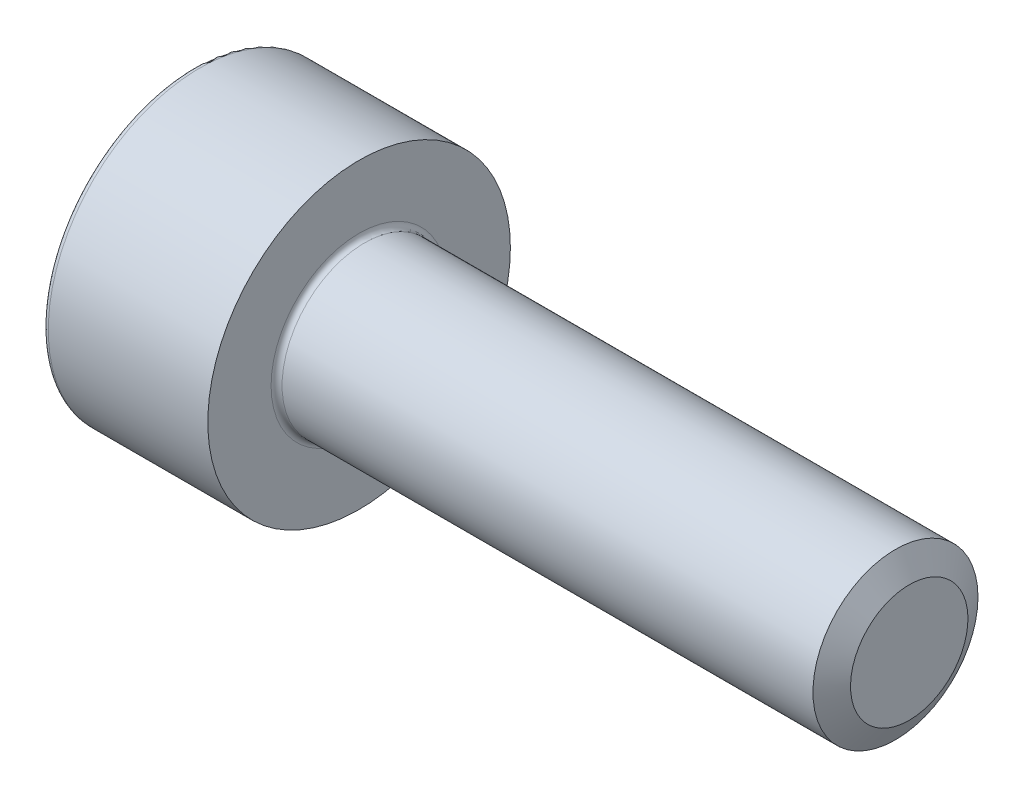
ISO-10303-21;
HEADER;
FILE_DESCRIPTION(('STEP AP214'),'2;1');
FILE_NAME('part.step','',(''),(''),'','','');
FILE_SCHEMA(('AUTOMOTIVE_DESIGN { 1 0 10303 214 1 1 1 1 }'));
ENDSEC;
DATA;
#1=APPLICATION_CONTEXT('core data for automotive mechanical design processes');
#2=APPLICATION_PROTOCOL_DEFINITION('international standard','automotive_design',2000,#1);
#3=PRODUCT_CONTEXT('',#1,'mechanical');
#4=PRODUCT('Part','Part','',(#3));
#5=PRODUCT_RELATED_PRODUCT_CATEGORY('part','',(#4));
#6=PRODUCT_DEFINITION_FORMATION('','',#4);
#7=PRODUCT_DEFINITION_CONTEXT('part definition',#1,'design');
#8=PRODUCT_DEFINITION('design','',#6,#7);
#9=PRODUCT_DEFINITION_SHAPE('','',#8);
#10=(LENGTH_UNIT() NAMED_UNIT(*) SI_UNIT(.MILLI.,.METRE.));
#11=(NAMED_UNIT(*) PLANE_ANGLE_UNIT() SI_UNIT($,.RADIAN.));
#12=(NAMED_UNIT(*) SI_UNIT($,.STERADIAN.) SOLID_ANGLE_UNIT());
#13=UNCERTAINTY_MEASURE_WITH_UNIT(LENGTH_MEASURE(1.E-05),#10,'distance_accuracy_value','');
#14=(GEOMETRIC_REPRESENTATION_CONTEXT(3) GLOBAL_UNCERTAINTY_ASSIGNED_CONTEXT((#13)) GLOBAL_UNIT_ASSIGNED_CONTEXT((#10,
#11,#12)) REPRESENTATION_CONTEXT('',''));
#15=CARTESIAN_POINT('',(0.,0.,0.));
#16=DIRECTION('',(0.,0.,1.));
#17=DIRECTION('',(1.,0.,0.));
#18=AXIS2_PLACEMENT_3D('',#15,#16,#17);
#19=CARTESIAN_POINT('',(1.3,-0.7175,1.24274645443067));
#20=DIRECTION('',(-1.,0.,0.));
#21=DIRECTION('',(0.,0.,1.));
#22=AXIS2_PLACEMENT_3D('',#19,#20,#21);
#23=PLANE('',#22);
#24=DIRECTION('',(0.,1.,0.));
#25=VECTOR('',#24,1.);
#26=CARTESIAN_POINT('',(1.3,0.7175,-1.24274645443067));
#27=LINE('',#26,#25);
#28=CARTESIAN_POINT('',(1.3,0.7175,-1.24274645443067));
#29=VERTEX_POINT('',#28);
#30=CARTESIAN_POINT('',(1.3,-0.7175,-1.24274645443067));
#31=VERTEX_POINT('',#30);
#32=EDGE_CURVE('E81',#29,#31,#27,.F.);
#33=ORIENTED_EDGE('',*,*,#32,.T.);
#34=DIRECTION('',(0.,0.5,-0.866025403784439));
#35=VECTOR('',#34,1.);
#36=CARTESIAN_POINT('',(1.3,-0.7175,-1.24274645443067));
#37=LINE('',#36,#35);
#38=CARTESIAN_POINT('',(1.3,-1.435,0.));
#39=VERTEX_POINT('',#38);
#40=EDGE_CURVE('E83',#31,#39,#37,.F.);
#41=ORIENTED_EDGE('',*,*,#40,.T.);
#42=DIRECTION('',(0.,-0.5,-0.866025403784439));
#43=VECTOR('',#42,1.);
#44=CARTESIAN_POINT('',(1.3,-1.435,0.));
#45=LINE('',#44,#43);
#46=CARTESIAN_POINT('',(1.3,-0.7175,1.24274645443067));
#47=VERTEX_POINT('',#46);
#48=EDGE_CURVE('E85',#39,#47,#45,.F.);
#49=ORIENTED_EDGE('',*,*,#48,.T.);
#50=DIRECTION('',(0.,-1.,0.));
#51=VECTOR('',#50,1.);
#52=CARTESIAN_POINT('',(1.3,-0.7175,1.24274645443067));
#53=LINE('',#52,#51);
#54=CARTESIAN_POINT('',(1.3,0.7175,1.24274645443067));
#55=VERTEX_POINT('',#54);
#56=EDGE_CURVE('E203',#47,#55,#53,.F.);
#57=ORIENTED_EDGE('',*,*,#56,.T.);
#58=DIRECTION('',(0.,-0.5,0.866025403784439));
#59=VECTOR('',#58,1.);
#60=CARTESIAN_POINT('',(1.3,0.7175,1.24274645443067));
#61=LINE('',#60,#59);
#62=CARTESIAN_POINT('',(1.3,1.435,0.));
#63=VERTEX_POINT('',#62);
#64=EDGE_CURVE('E208',#55,#63,#61,.F.);
#65=ORIENTED_EDGE('',*,*,#64,.T.);
#66=DIRECTION('',(0.,0.5,0.866025403784439));
#67=VECTOR('',#66,1.);
#68=CARTESIAN_POINT('',(1.3,1.435,0.));
#69=LINE('',#68,#67);
#70=EDGE_CURVE('E212',#63,#29,#69,.F.);
#71=ORIENTED_EDGE('',*,*,#70,.T.);
#72=EDGE_LOOP('',(#33,#41,#49,#57,#65,#71));
#73=FACE_BOUND('',#72,.T.);
#74=ADVANCED_FACE('F17',(#73),#23,.T.);
#75=CARTESIAN_POINT('',(1.3,-1.435,0.));
#76=DIRECTION('',(0.,-0.866025403784439,0.5));
#77=DIRECTION('',(0.,-0.5,-0.866025403784439));
#78=AXIS2_PLACEMENT_3D('',#75,#76,#77);
#79=PLANE('',#78);
#80=DIRECTION('',(1.,0.,0.));
#81=VECTOR('',#80,1.);
#82=CARTESIAN_POINT('',(1.3,-0.7175,1.24274645443067));
#83=LINE('',#82,#81);
#84=CARTESIAN_POINT('',(0.,-0.7175,1.24274645443067));
#85=VERTEX_POINT('',#84);
#86=EDGE_CURVE('E96',#85,#47,#83,.T.);
#87=ORIENTED_EDGE('',*,*,#86,.T.);
#88=ORIENTED_EDGE('',*,*,#48,.F.);
#89=DIRECTION('',(1.,0.,0.));
#90=VECTOR('',#89,1.);
#91=CARTESIAN_POINT('',(1.3,-1.435,0.));
#92=LINE('',#91,#90);
#93=CARTESIAN_POINT('',(0.,-1.435,0.));
#94=VERTEX_POINT('',#93);
#95=EDGE_CURVE('E90',#39,#94,#92,.F.);
#96=ORIENTED_EDGE('',*,*,#95,.T.);
#97=DIRECTION('',(0.,-0.5,-0.866025403784439));
#98=VECTOR('',#97,1.);
#99=CARTESIAN_POINT('',(0.,-0.7175,1.24274645443067));
#100=LINE('',#99,#98);
#101=EDGE_CURVE('E202',#85,#94,#100,.T.);
#102=ORIENTED_EDGE('',*,*,#101,.F.);
#103=EDGE_LOOP('',(#87,#88,#96,#102));
#104=FACE_BOUND('',#103,.T.);
#105=ADVANCED_FACE('F93',(#104),#79,.F.);
#106=CARTESIAN_POINT('',(1.3,-0.7175,-1.24274645443067));
#107=DIRECTION('',(0.,-0.866025403784439,-0.5));
#108=DIRECTION('',(0.,0.5,-0.866025403784439));
#109=AXIS2_PLACEMENT_3D('',#106,#107,#108);
#110=PLANE('',#109);
#111=ORIENTED_EDGE('',*,*,#95,.F.);
#112=ORIENTED_EDGE('',*,*,#40,.F.);
#113=DIRECTION('',(1.,0.,0.));
#114=VECTOR('',#113,1.);
#115=CARTESIAN_POINT('',(1.3,-0.7175,-1.24274645443067));
#116=LINE('',#115,#114);
#117=CARTESIAN_POINT('',(0.,-0.7175,-1.24274645443067));
#118=VERTEX_POINT('',#117);
#119=EDGE_CURVE('E104',#31,#118,#116,.F.);
#120=ORIENTED_EDGE('',*,*,#119,.T.);
#121=DIRECTION('',(0.,0.5,-0.866025403784439));
#122=VECTOR('',#121,1.);
#123=CARTESIAN_POINT('',(0.,-1.435,0.));
#124=LINE('',#123,#122);
#125=EDGE_CURVE('E101',#94,#118,#124,.T.);
#126=ORIENTED_EDGE('',*,*,#125,.F.);
#127=EDGE_LOOP('',(#111,#112,#120,#126));
#128=FACE_BOUND('',#127,.T.);
#129=ADVANCED_FACE('F99',(#128),#110,.F.);
#130=CARTESIAN_POINT('',(1.3,0.7175,-1.24274645443067));
#131=DIRECTION('',(0.,0.,-1.));
#132=DIRECTION('',(0.,1.,0.));
#133=AXIS2_PLACEMENT_3D('',#130,#131,#132);
#134=PLANE('',#133);
#135=ORIENTED_EDGE('',*,*,#119,.F.);
#136=ORIENTED_EDGE('',*,*,#32,.F.);
#137=DIRECTION('',(1.,0.,0.));
#138=VECTOR('',#137,1.);
#139=CARTESIAN_POINT('',(1.3,0.7175,-1.24274645443067));
#140=LINE('',#139,#138);
#141=CARTESIAN_POINT('',(0.,0.7175,-1.24274645443067));
#142=VERTEX_POINT('',#141);
#143=EDGE_CURVE('E210',#29,#142,#140,.F.);
#144=ORIENTED_EDGE('',*,*,#143,.T.);
#145=DIRECTION('',(0.,1.,0.));
#146=VECTOR('',#145,1.);
#147=CARTESIAN_POINT('',(0.,0.,-1.24274645443067));
#148=LINE('',#147,#146);
#149=EDGE_CURVE('E216',#118,#142,#148,.T.);
#150=ORIENTED_EDGE('',*,*,#149,.F.);
#151=EDGE_LOOP('',(#135,#136,#144,#150));
#152=FACE_BOUND('',#151,.T.);
#153=ADVANCED_FACE('F217',(#152),#134,.F.);
#154=CARTESIAN_POINT('',(1.3,1.435,0.));
#155=DIRECTION('',(0.,0.866025403784439,-0.5));
#156=DIRECTION('',(0.,0.5,0.866025403784439));
#157=AXIS2_PLACEMENT_3D('',#154,#155,#156);
#158=PLANE('',#157);
#159=ORIENTED_EDGE('',*,*,#143,.F.);
#160=ORIENTED_EDGE('',*,*,#70,.F.);
#161=DIRECTION('',(1.,0.,0.));
#162=VECTOR('',#161,1.);
#163=CARTESIAN_POINT('',(1.3,1.435,0.));
#164=LINE('',#163,#162);
#165=CARTESIAN_POINT('',(0.,1.435,0.));
#166=VERTEX_POINT('',#165);
#167=EDGE_CURVE('E206',#63,#166,#164,.F.);
#168=ORIENTED_EDGE('',*,*,#167,.T.);
#169=DIRECTION('',(0.,0.5,0.866025403784439));
#170=VECTOR('',#169,1.);
#171=CARTESIAN_POINT('',(0.,0.7175,-1.24274645443067));
#172=LINE('',#171,#170);
#173=EDGE_CURVE('E222',#142,#166,#172,.T.);
#174=ORIENTED_EDGE('',*,*,#173,.F.);
#175=EDGE_LOOP('',(#159,#160,#168,#174));
#176=FACE_BOUND('',#175,.T.);
#177=ADVANCED_FACE('F349',(#176),#158,.F.);
#178=CARTESIAN_POINT('',(1.3,0.7175,1.24274645443067));
#179=DIRECTION('',(0.,0.866025403784439,0.5));
#180=DIRECTION('',(0.,-0.5,0.866025403784439));
#181=AXIS2_PLACEMENT_3D('',#178,#179,#180);
#182=PLANE('',#181);
#183=ORIENTED_EDGE('',*,*,#167,.F.);
#184=ORIENTED_EDGE('',*,*,#64,.F.);
#185=DIRECTION('',(1.,0.,0.));
#186=VECTOR('',#185,1.);
#187=CARTESIAN_POINT('',(1.3,0.7175,1.24274645443067));
#188=LINE('',#187,#186);
#189=CARTESIAN_POINT('',(0.,0.7175,1.24274645443067));
#190=VERTEX_POINT('',#189);
#191=EDGE_CURVE('E195',#55,#190,#188,.F.);
#192=ORIENTED_EDGE('',*,*,#191,.T.);
#193=DIRECTION('',(0.,-0.5,0.866025403784439));
#194=VECTOR('',#193,1.);
#195=CARTESIAN_POINT('',(0.,1.435,0.));
#196=LINE('',#195,#194);
#197=EDGE_CURVE('E230',#166,#190,#196,.T.);
#198=ORIENTED_EDGE('',*,*,#197,.F.);
#199=EDGE_LOOP('',(#183,#184,#192,#198));
#200=FACE_BOUND('',#199,.T.);
#201=ADVANCED_FACE('F258',(#200),#182,.F.);
#202=CARTESIAN_POINT('',(1.3,-0.7175,1.24274645443067));
#203=DIRECTION('',(0.,0.,1.));
#204=DIRECTION('',(0.,-1.,0.));
#205=AXIS2_PLACEMENT_3D('',#202,#203,#204);
#206=PLANE('',#205);
#207=ORIENTED_EDGE('',*,*,#191,.F.);
#208=ORIENTED_EDGE('',*,*,#56,.F.);
#209=ORIENTED_EDGE('',*,*,#86,.F.);
#210=DIRECTION('',(0.,1.,0.));
#211=VECTOR('',#210,1.);
#212=CARTESIAN_POINT('',(0.,0.,1.24274645443067));
#213=LINE('',#212,#211);
#214=EDGE_CURVE('E232',#190,#85,#213,.F.);
#215=ORIENTED_EDGE('',*,*,#214,.F.);
#216=EDGE_LOOP('',(#207,#208,#209,#215));
#217=FACE_BOUND('',#216,.T.);
#218=ADVANCED_FACE('F253',(#217),#206,.F.);
#219=CARTESIAN_POINT('',(0.,0.,0.));
#220=DIRECTION('',(-1.,0.,0.));
#221=DIRECTION('',(0.,0.,1.));
#222=AXIS2_PLACEMENT_3D('',#219,#220,#221);
#223=PLANE('',#222);
#224=ORIENTED_EDGE('',*,*,#197,.T.);
#225=ORIENTED_EDGE('',*,*,#214,.T.);
#226=ORIENTED_EDGE('',*,*,#101,.T.);
#227=ORIENTED_EDGE('',*,*,#125,.T.);
#228=ORIENTED_EDGE('',*,*,#149,.T.);
#229=ORIENTED_EDGE('',*,*,#173,.T.);
#230=EDGE_LOOP('',(#224,#225,#226,#227,#228,#229));
#231=FACE_BOUND('',#230,.T.);
#232=CARTESIAN_POINT('',(0.,0.,0.));
#233=DIRECTION('',(1.,0.,0.));
#234=DIRECTION('',(0.,0.,-1.));
#235=AXIS2_PLACEMENT_3D('',#232,#233,#234);
#236=CIRCLE('',#235,2.65);
#237=CARTESIAN_POINT('',(0.,0.,-2.65));
#238=VERTEX_POINT('',#237);
#239=CARTESIAN_POINT('',(0.,0.,2.65));
#240=VERTEX_POINT('',#239);
#241=EDGE_CURVE('E234',#238,#240,#236,.T.);
#242=ORIENTED_EDGE('',*,*,#241,.F.);
#243=CARTESIAN_POINT('',(0.,0.,0.));
#244=DIRECTION('',(1.,0.,0.));
#245=DIRECTION('',(0.,0.,1.));
#246=AXIS2_PLACEMENT_3D('',#243,#244,#245);
#247=CIRCLE('',#246,2.65);
#248=EDGE_CURVE('E175',#240,#238,#247,.T.);
#249=ORIENTED_EDGE('',*,*,#248,.F.);
#250=EDGE_LOOP('',(#242,#249));
#251=FACE_BOUND('',#250,.T.);
#252=ADVANCED_FACE('F183',(#231,#251),#223,.T.);
#253=CARTESIAN_POINT('',(0.1,0.,0.));
#254=DIRECTION('',(-1.,0.,0.));
#255=DIRECTION('',(0.,0.,1.));
#256=AXIS2_PLACEMENT_3D('',#253,#254,#255);
#257=TOROIDAL_SURFACE('',#256,2.65,0.1);
#258=CARTESIAN_POINT('',(0.1,0.,0.));
#259=DIRECTION('',(1.,0.,0.));
#260=DIRECTION('',(0.,0.,-1.));
#261=AXIS2_PLACEMENT_3D('',#258,#259,#260);
#262=CIRCLE('',#261,2.75);
#263=CARTESIAN_POINT('',(0.1,0.,-2.75));
#264=VERTEX_POINT('',#263);
#265=EDGE_CURVE('E115',#264,#264,#262,.T.);
#266=ORIENTED_EDGE('',*,*,#265,.F.);
#267=EDGE_LOOP('',(#266));
#268=FACE_BOUND('',#267,.T.);
#269=ORIENTED_EDGE('',*,*,#248,.T.);
#270=ORIENTED_EDGE('',*,*,#241,.T.);
#271=EDGE_LOOP('',(#269,#270));
#272=FACE_BOUND('',#271,.T.);
#273=ADVANCED_FACE('F179',(#268,#272),#257,.T.);
#274=CARTESIAN_POINT('',(0.,0.,0.));
#275=DIRECTION('',(1.,0.,0.));
#276=DIRECTION('',(0.,0.,-1.));
#277=AXIS2_PLACEMENT_3D('',#274,#275,#276);
#278=CYLINDRICAL_SURFACE('',#277,2.75);
#279=ORIENTED_EDGE('',*,*,#265,.T.);
#280=EDGE_LOOP('',(#279));
#281=FACE_BOUND('',#280,.T.);
#282=CARTESIAN_POINT('',(3.,0.,0.));
#283=DIRECTION('',(1.,0.,0.));
#284=DIRECTION('',(0.,0.,-1.));
#285=AXIS2_PLACEMENT_3D('',#282,#283,#284);
#286=CIRCLE('',#285,2.75);
#287=CARTESIAN_POINT('',(3.,0.,-2.75));
#288=VERTEX_POINT('',#287);
#289=EDGE_CURVE('E111',#288,#288,#286,.T.);
#290=ORIENTED_EDGE('',*,*,#289,.F.);
#291=EDGE_LOOP('',(#290));
#292=FACE_BOUND('',#291,.T.);
#293=ADVANCED_FACE('F155',(#281,#292),#278,.T.);
#294=CARTESIAN_POINT('',(3.,2.75,0.));
#295=DIRECTION('',(1.,0.,0.));
#296=DIRECTION('',(0.,0.,-1.));
#297=AXIS2_PLACEMENT_3D('',#294,#295,#296);
#298=PLANE('',#297);
#299=CARTESIAN_POINT('',(3.,0.,0.));
#300=DIRECTION('',(1.,0.,0.));
#301=DIRECTION('',(0.,0.,-1.));
#302=AXIS2_PLACEMENT_3D('',#299,#300,#301);
#303=CIRCLE('',#302,1.6);
#304=CARTESIAN_POINT('',(3.,0.,1.6));
#305=VERTEX_POINT('',#304);
#306=CARTESIAN_POINT('',(3.,0.,-1.6));
#307=VERTEX_POINT('',#306);
#308=EDGE_CURVE('E36',#305,#307,#303,.F.);
#309=ORIENTED_EDGE('',*,*,#308,.T.);
#310=CARTESIAN_POINT('',(3.,0.,0.));
#311=DIRECTION('',(1.,0.,0.));
#312=DIRECTION('',(0.,0.,1.));
#313=AXIS2_PLACEMENT_3D('',#310,#311,#312);
#314=CIRCLE('',#313,1.6);
#315=EDGE_CURVE('E114',#307,#305,#314,.F.);
#316=ORIENTED_EDGE('',*,*,#315,.T.);
#317=EDGE_LOOP('',(#309,#316));
#318=FACE_BOUND('',#317,.T.);
#319=ORIENTED_EDGE('',*,*,#289,.T.);
#320=EDGE_LOOP('',(#319));
#321=FACE_BOUND('',#320,.T.);
#322=ADVANCED_FACE('F146',(#318,#321),#298,.T.);
#323=CARTESIAN_POINT('',(13.,1.5,0.));
#324=DIRECTION('',(1.,0.,0.));
#325=DIRECTION('',(0.,0.,-1.));
#326=AXIS2_PLACEMENT_3D('',#323,#324,#325);
#327=PLANE('',#326);
#328=CARTESIAN_POINT('',(13.0000000000337,0.,0.));
#329=DIRECTION('',(-1.,0.,0.));
#330=DIRECTION('',(0.,-1.,0.));
#331=AXIS2_PLACEMENT_3D('',#328,#329,#330);
#332=CIRCLE('',#331,1.06699999997772);
#333=CARTESIAN_POINT('',(13.0000000000337,-1.06699999997772,0.));
#334=VERTEX_POINT('',#333);
#335=EDGE_CURVE('E108',#334,#334,#332,.T.);
#336=ORIENTED_EDGE('',*,*,#335,.F.);
#337=EDGE_LOOP('',(#336));
#338=FACE_BOUND('',#337,.T.);
#339=ADVANCED_FACE('F133',(#338),#327,.T.);
#340=CARTESIAN_POINT('',(3.1,0.,0.));
#341=DIRECTION('',(1.,0.,0.));
#342=DIRECTION('',(0.,0.,-1.));
#343=AXIS2_PLACEMENT_3D('',#340,#341,#342);
#344=TOROIDAL_SURFACE('',#343,1.6,0.1);
#345=CARTESIAN_POINT('',(3.1,0.,0.));
#346=DIRECTION('',(1.,0.,0.));
#347=DIRECTION('',(0.,0.,-1.));
#348=AXIS2_PLACEMENT_3D('',#345,#346,#347);
#349=CIRCLE('',#348,1.5);
#350=CARTESIAN_POINT('',(3.1,0.,-1.5));
#351=VERTEX_POINT('',#350);
#352=EDGE_CURVE('E28',#351,#351,#349,.T.);
#353=ORIENTED_EDGE('',*,*,#352,.F.);
#354=EDGE_LOOP('',(#353));
#355=FACE_BOUND('',#354,.T.);
#356=ORIENTED_EDGE('',*,*,#315,.F.);
#357=ORIENTED_EDGE('',*,*,#308,.F.);
#358=EDGE_LOOP('',(#356,#357));
#359=FACE_BOUND('',#358,.T.);
#360=ADVANCED_FACE('F121',(#355,#359),#344,.F.);
#361=CARTESIAN_POINT('',(12.7499999999827,0.,0.));
#362=DIRECTION('',(-1.,0.,0.));
#363=DIRECTION('',(0.,-1.,0.));
#364=AXIS2_PLACEMENT_3D('',#361,#362,#363);
#365=CONICAL_SURFACE('',#364,1.50000000007822,1.04718484903721);
#366=CARTESIAN_POINT('',(12.75,0.,0.));
#367=DIRECTION('',(1.,0.,0.));
#368=DIRECTION('',(0.,0.,-1.));
#369=AXIS2_PLACEMENT_3D('',#366,#367,#368);
#370=CIRCLE('',#369,1.5);
#371=CARTESIAN_POINT('',(12.75,0.,-1.5));
#372=VERTEX_POINT('',#371);
#373=EDGE_CURVE('E11',#372,#372,#370,.F.);
#374=ORIENTED_EDGE('',*,*,#373,.F.);
#375=EDGE_LOOP('',(#374));
#376=FACE_BOUND('',#375,.T.);
#377=ORIENTED_EDGE('',*,*,#335,.T.);
#378=EDGE_LOOP('',(#377));
#379=FACE_BOUND('',#378,.T.);
#380=ADVANCED_FACE('F132',(#376,#379),#365,.T.);
#381=CARTESIAN_POINT('',(0.,0.,0.));
#382=DIRECTION('',(1.,0.,0.));
#383=DIRECTION('',(0.,0.,-1.));
#384=AXIS2_PLACEMENT_3D('',#381,#382,#383);
#385=CYLINDRICAL_SURFACE('',#384,1.5);
#386=ORIENTED_EDGE('',*,*,#373,.T.);
#387=EDGE_LOOP('',(#386));
#388=FACE_BOUND('',#387,.T.);
#389=ORIENTED_EDGE('',*,*,#352,.T.);
#390=EDGE_LOOP('',(#389));
#391=FACE_BOUND('',#390,.T.);
#392=ADVANCED_FACE('F260',(#388,#391),#385,.T.);
#393=CLOSED_SHELL('',(#74,#105,#129,#153,#177,#201,#218,#252,#273,#293,#322,#339,#360,#380,#392));
#394=MANIFOLD_SOLID_BREP('B1',#393);
#395=ADVANCED_BREP_SHAPE_REPRESENTATION('',(#18,#394),#14);
#396=SHAPE_DEFINITION_REPRESENTATION(#9,#395);
ENDSEC;
END-ISO-10303-21;
